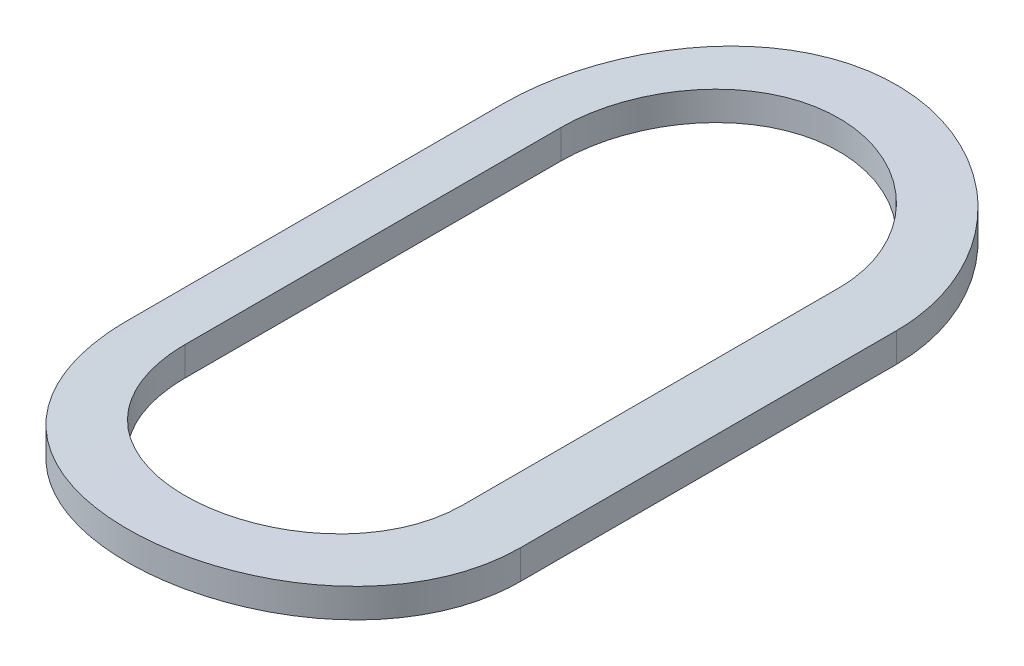
ISO-10303-21;
HEADER;
FILE_DESCRIPTION(('STEP AP214'),'2;1');
FILE_NAME('part.step','',(''),(''),'','','');
FILE_SCHEMA(('AUTOMOTIVE_DESIGN { 1 0 10303 214 1 1 1 1 }'));
ENDSEC;
DATA;
#1=APPLICATION_CONTEXT('core data for automotive mechanical design processes');
#2=APPLICATION_PROTOCOL_DEFINITION('international standard','automotive_design',2000,#1);
#3=PRODUCT_CONTEXT('',#1,'mechanical');
#4=PRODUCT('Part','Part','',(#3));
#5=PRODUCT_RELATED_PRODUCT_CATEGORY('part','',(#4));
#6=PRODUCT_DEFINITION_FORMATION('','',#4);
#7=PRODUCT_DEFINITION_CONTEXT('part definition',#1,'design');
#8=PRODUCT_DEFINITION('design','',#6,#7);
#9=PRODUCT_DEFINITION_SHAPE('','',#8);
#10=(LENGTH_UNIT() NAMED_UNIT(*) SI_UNIT(.MILLI.,.METRE.));
#11=(NAMED_UNIT(*) PLANE_ANGLE_UNIT() SI_UNIT($,.RADIAN.));
#12=(NAMED_UNIT(*) SI_UNIT($,.STERADIAN.) SOLID_ANGLE_UNIT());
#13=UNCERTAINTY_MEASURE_WITH_UNIT(LENGTH_MEASURE(1.E-05),#10,'distance_accuracy_value','');
#14=(GEOMETRIC_REPRESENTATION_CONTEXT(3) GLOBAL_UNCERTAINTY_ASSIGNED_CONTEXT((#13)) GLOBAL_UNIT_ASSIGNED_CONTEXT((#10,
#11,#12)) REPRESENTATION_CONTEXT('',''));
#15=CARTESIAN_POINT('',(0.,0.,0.));
#16=DIRECTION('',(0.,0.,1.));
#17=DIRECTION('',(1.,0.,0.));
#18=AXIS2_PLACEMENT_3D('',#15,#16,#17);
#19=CARTESIAN_POINT('',(-205.237767720161,-97.4477839792411,1.93657000024673));
#20=DIRECTION('',(0.,0.,1.));
#21=DIRECTION('',(1.,0.,0.));
#22=AXIS2_PLACEMENT_3D('',#19,#20,#21);
#23=CYLINDRICAL_SURFACE('',#22,5.00000000000003);
#24=CARTESIAN_POINT('',(-205.816025312001,-92.4813347287726,1.26705566906289));
#25=CARTESIAN_POINT('',(-205.81605345322,-92.4813470455981,1.23463948872488));
#26=CARTESIAN_POINT('',(-205.813301256707,-92.4810176953498,1.20223402357542));
#27=CARTESIAN_POINT('',(-205.802446677341,-92.4797671542148,1.13837574289803));
#28=CARTESIAN_POINT('',(-205.794349708049,-92.4788465622047,1.10692199708068));
#29=CARTESIAN_POINT('',(-205.773011592033,-92.4765042816047,1.04581857159093));
#30=CARTESIAN_POINT('',(-205.759768660538,-92.4750824191753,1.01616952197208));
#31=CARTESIAN_POINT('',(-205.728529674045,-92.4719021558279,0.959516628595261));
#32=CARTESIAN_POINT('',(-205.710534070537,-92.4701437868815,0.932512533908092));
#33=CARTESIAN_POINT('',(-205.670207756246,-92.4664783744416,0.881787170962236));
#34=CARTESIAN_POINT('',(-205.647859171863,-92.4645707380577,0.858080153163646));
#35=CARTESIAN_POINT('',(-205.599497501548,-92.460827112354,0.814741829426306));
#36=CARTESIAN_POINT('',(-205.573483858366,-92.4589911339836,0.795111144393086));
#37=CARTESIAN_POINT('',(-205.518441967116,-92.4555917582716,0.760434779110705));
#38=CARTESIAN_POINT('',(-205.489405485113,-92.4540291382538,0.745402085847956));
#39=CARTESIAN_POINT('',(-205.429200909222,-92.4513592357457,0.720432369036958));
#40=CARTESIAN_POINT('',(-205.398033010825,-92.4502519115612,0.710494878870033));
#41=CARTESIAN_POINT('',(-205.334596648131,-92.4486214638352,0.696039431545395));
#42=CARTESIAN_POINT('',(-205.302333729771,-92.4480957495245,0.691497433550026));
#43=CARTESIAN_POINT('',(-205.237498790808,-92.4476789168199,0.68788741976829));
#44=CARTESIAN_POINT('',(-205.204926773204,-92.4477877922755,0.688819350928871));
#45=CARTESIAN_POINT('',(-205.140563410856,-92.4486257894006,0.69611157320164));
#46=CARTESIAN_POINT('',(-205.108769075323,-92.4493519393145,0.702445856156936));
#47=CARTESIAN_POINT('',(-205.046697948224,-92.4513395212461,0.720322340750338));
#48=CARTESIAN_POINT('',(-205.016421173954,-92.4526009593627,0.731864601727575));
#49=CARTESIAN_POINT('',(-204.958162773233,-92.4555225006161,0.759857664963238));
#50=CARTESIAN_POINT('',(-204.930186698027,-92.4571835321094,0.776319919517496));
#51=CARTESIAN_POINT('',(-204.87738579882,-92.4607180906581,0.81367655545566));
#52=CARTESIAN_POINT('',(-204.852560962508,-92.4625916168832,0.834570919522312));
#53=CARTESIAN_POINT('',(-204.806616299284,-92.4663540775476,0.880341586026456));
#54=CARTESIAN_POINT('',(-204.785518493568,-92.4682430387985,0.905239996827522));
#55=CARTESIAN_POINT('',(-204.747792196947,-92.4718132541877,0.958244851151854));
#56=CARTESIAN_POINT('',(-204.731165046413,-92.473494445952,0.986352253189719));
#57=CARTESIAN_POINT('',(-204.702849827051,-92.4764596597479,1.04500439396428));
#58=CARTESIAN_POINT('',(-204.691166312109,-92.4777433152941,1.07555134927183));
#59=CARTESIAN_POINT('',(-204.67312304922,-92.479759834021,1.13815473004957));
#60=CARTESIAN_POINT('',(-204.666755270332,-92.4804935279044,1.170208800908));
#61=CARTESIAN_POINT('',(-204.660710580302,-92.4811955947182,1.22397438759136));
#62=CARTESIAN_POINT('',(-204.659499727931,-92.4813388156744,1.24552013612972));
#63=CARTESIAN_POINT('',(-204.659510128705,-92.4813347287279,1.26705566906289));
#64=B_SPLINE_CURVE_WITH_KNOTS('',3,(#24,#25,#26,#27,#28,#29,#30,#31,#32,#33,#34,#35,#36,#37,#38,
#39,#40,#41,#42,#43,#44,#45,#46,#47,#48,#49,#50,#51,#52,#53,#54,#55,#56,#57,#58,#59,#60,#61,#62,
#63),.UNSPECIFIED.,.F.,.F.,(4,2,2,2,2,2,2,2,2,2,2,2,2,2,2,2,2,2,2,4),(0.,0.0971144596016327,
0.194130705508774,0.291180629617421,0.3882213375778,0.485669235955009,0.583131966690333,
0.680867490696588,0.778594062484607,0.875883538275932,0.973172071143984,1.06999486157766,
1.16681875522746,1.2638698053772,1.36092047633352,1.4585266740161,1.55616210298787,
1.65388727516013,1.75146453691094,1.81606442695371),.UNSPECIFIED.);
#65=CARTESIAN_POINT('',(-205.816025312001,-92.4813347287725,1.26705566906289));
#66=VERTEX_POINT('',#65);
#67=CARTESIAN_POINT('',(-204.659510128705,-92.4813347287279,1.26705566906289));
#68=VERTEX_POINT('',#67);
#69=EDGE_CURVE('E173',#66,#68,#64,.T.);
#70=ORIENTED_EDGE('',*,*,#69,.T.);
#71=DIRECTION('',(0.,0.,1.));
#72=VECTOR('',#71,1.);
#73=CARTESIAN_POINT('',(-204.659510128705,-92.4813347287279,1.26705566906289));
#74=LINE('',#73,#72);
#75=CARTESIAN_POINT('',(-204.659510128705,-92.4813347287279,2.83206474743267));
#76=VERTEX_POINT('',#75);
#77=EDGE_CURVE('E111',#76,#68,#74,.F.);
#78=ORIENTED_EDGE('',*,*,#77,.F.);
#79=CARTESIAN_POINT('',(-204.659510128705,-92.4813347287279,2.83206474743267));
#80=CARTESIAN_POINT('',(-204.65948198318,-92.4813470453749,2.86448083062688));
#81=CARTESIAN_POINT('',(-204.66223416535,-92.4810176971892,2.89688619887213));
#82=CARTESIAN_POINT('',(-204.673088717127,-92.4797671597198,2.96074448500112));
#83=CARTESIAN_POINT('',(-204.681185705116,-92.4788465657793,2.99219832768205));
#84=CARTESIAN_POINT('',(-204.702524070631,-92.4765042566045,3.0533024933699));
#85=CARTESIAN_POINT('',(-204.715767326654,-92.4750823584012,3.08295215323607));
#86=CARTESIAN_POINT('',(-204.747006549714,-92.4719020810574,3.1396049404931));
#87=CARTESIAN_POINT('',(-204.765001863621,-92.4701437481661,3.16660843087947));
#88=CARTESIAN_POINT('',(-204.805325364428,-92.4664785790867,3.21733039993261));
#89=CARTESIAN_POINT('',(-204.827671036202,-92.4645711628689,3.24103493719126));
#90=CARTESIAN_POINT('',(-204.876032349208,-92.4608275253215,3.28437421471046));
#91=CARTESIAN_POINT('',(-204.902049364491,-92.4589913309773,3.30400742439501));
#92=CARTESIAN_POINT('',(-204.957107529511,-92.4555908299197,3.33869494452619));
#93=CARTESIAN_POINT('',(-204.986158174165,-92.4540274204009,3.35373426293954));
#94=CARTESIAN_POINT('',(-205.046371666948,-92.4513580548523,3.37869922051582));
#95=CARTESIAN_POINT('',(-205.077531998354,-92.4502515645608,3.3886308353169));
#96=CARTESIAN_POINT('',(-205.130346152671,-92.4488934431359,3.40066816087082));
#97=CARTESIAN_POINT('',(-205.151664012772,-92.4484793797971,3.40428335727668));
#98=CARTESIAN_POINT('',(-205.194574057236,-92.4479245041211,3.40911092828111));
#99=CARTESIAN_POINT('',(-205.216166245618,-92.4477836957932,3.41032326762364));
#100=CARTESIAN_POINT('',(-205.270132833281,-92.4477844039261,3.41032094786131));
#101=CARTESIAN_POINT('',(-205.302518792684,-92.448101558574,3.40759595145512));
#102=CARTESIAN_POINT('',(-205.36639046982,-92.449336246177,3.39676770255847));
#103=CARTESIAN_POINT('',(-205.397875198235,-92.4502544143552,3.38865875953881));
#104=CARTESIAN_POINT('',(-205.459010687186,-92.4525875978119,3.36730369344967));
#105=CARTESIAN_POINT('',(-205.488662624789,-92.4540022902267,3.35406090806612));
#106=CARTESIAN_POINT('',(-205.545317635545,-92.4571708752444,3.32282065546445));
#107=CARTESIAN_POINT('',(-205.572321144898,-92.4589247118479,3.30482397303095));
#108=CARTESIAN_POINT('',(-205.623045523049,-92.4625847434808,3.26449632593292));
#109=CARTESIAN_POINT('',(-205.646752120136,-92.4644915478026,3.24214746487877));
#110=CARTESIAN_POINT('',(-205.690087991771,-92.4682377457699,3.19378617130073));
#111=CARTESIAN_POINT('',(-205.709716908808,-92.4700771334931,3.16777341788066));
#112=CARTESIAN_POINT('',(-205.744395340358,-92.4734866329095,3.11272837641825));
#113=CARTESIAN_POINT('',(-205.759430426865,-92.4750558895899,3.083686951524));
#114=CARTESIAN_POINT('',(-205.784398136002,-92.4777383200303,3.02347434336882));
#115=CARTESIAN_POINT('',(-205.794333600315,-92.4788517477236,2.99230435721046));
#116=CARTESIAN_POINT('',(-205.806375173798,-92.4802182866102,2.93946661392135));
#117=CARTESIAN_POINT('',(-205.809991257807,-92.4806348583557,2.91813495665772));
#118=CARTESIAN_POINT('',(-205.81481628588,-92.4811939415349,2.87522689266801));
#119=CARTESIAN_POINT('',(-205.816028473882,-92.4813368222921,2.85365085534277));
#120=CARTESIAN_POINT('',(-205.816025312001,-92.4813347287726,2.83206474743267));
#121=B_SPLINE_CURVE_WITH_KNOTS('',3,(#79,#80,#81,#82,#83,#84,#85,#86,#87,#88,#89,#90,#91,#92,
#93,#94,#95,#96,#97,#98,#99,#100,#101,#102,#103,#104,#105,#106,#107,#108,#109,#110,#111,#112,
#113,#114,#115,#116,#117,#118,#119,#120),.UNSPECIFIED.,.F.,.F.,(4,2,2,2,2,2,2,2,2,2,2,2,2,2,2,2,
2,2,2,2,4),(0.,0.0971141698560029,0.194130705514869,0.291182687565263,0.38822133755357,
0.485658369900073,0.583131966607677,0.680920348294443,0.778594063001647,0.843344867671632,
0.908096622394172,1.00511304740932,1.10223217692015,1.19928827157682,1.29632835398478,
1.3937762336066,1.49123265335908,1.58899208404563,1.68669698057032,1.75148885975865,
1.81619324588166),.UNSPECIFIED.);
#122=CARTESIAN_POINT('',(-205.816025312001,-92.4813347287725,2.83206474743267));
#123=VERTEX_POINT('',#122);
#124=EDGE_CURVE('E118',#76,#123,#121,.T.);
#125=ORIENTED_EDGE('',*,*,#124,.T.);
#126=DIRECTION('',(0.,0.,-1.));
#127=VECTOR('',#126,1.);
#128=CARTESIAN_POINT('',(-205.816025312001,-92.4813347287725,2.83206474743267));
#129=LINE('',#128,#127);
#130=EDGE_CURVE('E115',#66,#123,#129,.F.);
#131=ORIENTED_EDGE('',*,*,#130,.F.);
#132=EDGE_LOOP('',(#70,#78,#125,#131));
#133=FACE_BOUND('',#132,.T.);
#134=DIRECTION('',(0.,0.,1.));
#135=VECTOR('',#134,1.);
#136=CARTESIAN_POINT('',(-206.056025312001,-92.5151929244914,1.26705559221961));
#137=LINE('',#136,#135);
#138=CARTESIAN_POINT('',(-206.056025312001,-92.5151929244914,2.83206489963483));
#139=VERTEX_POINT('',#138);
#140=CARTESIAN_POINT('',(-206.056025312001,-92.5151929244914,1.26705564985207));
#141=VERTEX_POINT('',#140);
#142=EDGE_CURVE('E98',#139,#141,#137,.F.);
#143=ORIENTED_EDGE('',*,*,#142,.F.);
#144=CARTESIAN_POINT('',(-204.419510128705,-92.5151929244278,2.83206478585431));
#145=CARTESIAN_POINT('',(-204.419469583894,-92.5152177455033,2.87777147739796));
#146=CARTESIAN_POINT('',(-204.423337202401,-92.514558298794,2.92345946863485));
#147=CARTESIAN_POINT('',(-204.438581215502,-92.5120563218705,3.01347416657745));
#148=CARTESIAN_POINT('',(-204.449947946265,-92.5102153143735,3.05780254852657));
#149=CARTESIAN_POINT('',(-204.479887760545,-92.505534208199,3.14390882887328));
#150=CARTESIAN_POINT('',(-204.498462619333,-92.5026938634135,3.18568609602752));
#151=CARTESIAN_POINT('',(-204.542264858439,-92.496343081097,3.26553173869358));
#152=CARTESIAN_POINT('',(-204.567492006978,-92.4928326669135,3.30360024336224));
#153=CARTESIAN_POINT('',(-204.624135409762,-92.4854987717767,3.37530128514741));
#154=CARTESIAN_POINT('',(-204.65560135479,-92.481672931592,3.40889432927821));
#155=CARTESIAN_POINT('',(-204.723733811126,-92.4741593685713,3.47035939904949));
#156=CARTESIAN_POINT('',(-204.760402239161,-92.4704716972759,3.49822930683726));
#157=CARTESIAN_POINT('',(-204.838163315761,-92.4636242885595,3.54760415496366));
#158=CARTESIAN_POINT('',(-204.87928180731,-92.4604679404276,3.5690688613223));
#159=CARTESIAN_POINT('',(-204.964570477406,-92.4550711398516,3.60474879480461));
#160=CARTESIAN_POINT('',(-205.008736994849,-92.4528296102206,3.61897255296315));
#161=CARTESIAN_POINT('',(-205.083910694341,-92.4500602914303,3.63632344402966));
#162=CARTESIAN_POINT('',(-205.114434780676,-92.4492108397193,3.64156518110267));
#163=CARTESIAN_POINT('',(-205.175890775964,-92.4480724009212,3.64856531130345));
#164=CARTESIAN_POINT('',(-205.206822688049,-92.4477834181408,3.65032367766514));
#165=CARTESIAN_POINT('',(-205.283398607863,-92.4477848066276,3.65032036523282));
#166=CARTESIAN_POINT('',(-205.329058023749,-92.448415213171,3.64649211968619));
#167=CARTESIAN_POINT('',(-205.419099966746,-92.450869588219,3.63128507440123));
#168=CARTESIAN_POINT('',(-205.463481130311,-92.4526947853451,3.61989850215043));
#169=CARTESIAN_POINT('',(-205.549646007249,-92.4573338703443,3.58992731322613));
#170=CARTESIAN_POINT('',(-205.591431903344,-92.4601469137761,3.57134884302327));
#171=CARTESIAN_POINT('',(-205.671287461548,-92.4664521176568,3.5275361761613));
#172=CARTESIAN_POINT('',(-205.709357582195,-92.4699441941514,3.50230280216413));
#173=CARTESIAN_POINT('',(-205.781057576196,-92.4772560952725,3.44564959471385));
#174=CARTESIAN_POINT('',(-205.814648260083,-92.481078384344,3.41418047881052));
#175=CARTESIAN_POINT('',(-205.876098923618,-92.4886011796767,3.34605227981666));
#176=CARTESIAN_POINT('',(-205.903958316683,-92.4923016734399,3.30939266614047));
#177=CARTESIAN_POINT('',(-205.953315865383,-92.4991864135317,3.23165192320347));
#178=CARTESIAN_POINT('',(-205.974773689082,-92.5023673318523,3.19054489544946));
#179=CARTESIAN_POINT('',(-206.010454954267,-92.5078161409318,3.10525570250481));
#180=CARTESIAN_POINT('',(-206.024682761172,-92.510084582463,3.06107541128852));
#181=CARTESIAN_POINT('',(-206.042035603347,-92.5128875242913,2.98587440469699));
#182=CARTESIAN_POINT('',(-206.047276741209,-92.5137474123375,2.95533733217677));
#183=CARTESIAN_POINT('',(-206.054272095082,-92.5149020576824,2.89389316153447));
#184=CARTESIAN_POINT('',(-206.056030475274,-92.5151974898613,2.86298654981203));
#185=CARTESIAN_POINT('',(-206.056025312001,-92.5151929244915,2.83206489963483));
#186=B_SPLINE_CURVE_WITH_KNOTS('',3,(#144,#145,#146,#147,#148,#149,#150,#151,#152,#153,#154,
#155,#156,#157,#158,#159,#160,#161,#162,#163,#164,#165,#166,#167,#168,#169,#170,#171,#172,#173,
#174,#175,#176,#177,#178,#179,#180,#181,#182,#183,#184,#185),.UNSPECIFIED.,.F.,.F.,(4,2,2,2,2,2,
2,2,2,2,2,2,2,2,2,2,2,2,2,2,4),(0.,0.136923950960332,0.273671796791195,0.410453343293103,
0.54723012470334,0.685143554436085,0.823107927577547,0.961921508066514,1.10057116248184,
1.19332857538333,1.28608670102633,1.42286586335767,1.55978589921435,1.69658917540756,
1.83337554825506,1.97128949854096,2.10921755692804,2.24799709478118,2.38669273896364,
2.47948852703615,2.57217329610049),.UNSPECIFIED.);
#187=CARTESIAN_POINT('',(-204.419510128705,-92.5151929244278,2.83206476664349));
#188=VERTEX_POINT('',#187);
#189=EDGE_CURVE('E21',#188,#139,#186,.T.);
#190=ORIENTED_EDGE('',*,*,#189,.F.);
#191=DIRECTION('',(0.,0.,-1.));
#192=VECTOR('',#191,1.);
#193=CARTESIAN_POINT('',(-204.419510128705,-92.5151929244278,2.83206482427595));
#194=LINE('',#193,#192);
#195=CARTESIAN_POINT('',(-204.419510128705,-92.5151929244278,1.26705548326462));
#196=VERTEX_POINT('',#195);
#197=EDGE_CURVE('E85',#196,#188,#194,.F.);
#198=ORIENTED_EDGE('',*,*,#197,.F.);
#199=CARTESIAN_POINT('',(-206.056025312001,-92.5151929244915,1.26705563064125));
#200=CARTESIAN_POINT('',(-206.056065850808,-92.515217745583,1.22134883097487));
#201=CARTESIAN_POINT('',(-206.052198216996,-92.5145582957453,1.17566073182648));
#202=CARTESIAN_POINT('',(-206.036954174544,-92.5120563133006,1.08564603993076));
#203=CARTESIAN_POINT('',(-206.025587465142,-92.5102153089893,1.04131776579762));
#204=CARTESIAN_POINT('',(-205.995647976741,-92.505534255493,0.955212458491268));
#205=CARTESIAN_POINT('',(-205.977073551117,-92.502693978035,0.913436010816652));
#206=CARTESIAN_POINT('',(-205.933271629356,-92.4963432223219,0.833590226531871));
#207=CARTESIAN_POINT('',(-205.908044096061,-92.4928327403238,0.795520910628242));
#208=CARTESIAN_POINT('',(-205.851396862148,-92.485498374046,0.72381522193847));
#209=CARTESIAN_POINT('',(-205.819926933647,-92.4816721051632,0.690218766535334));
#210=CARTESIAN_POINT('',(-205.751793995122,-92.4741585643196,0.628754998734168));
#211=CARTESIAN_POINT('',(-205.715130190961,-92.4704713137239,0.600888564049017));
#212=CARTESIAN_POINT('',(-205.637391631918,-92.463626125481,0.551529285253124));
#213=CARTESIAN_POINT('',(-205.596292805583,-92.4604713419292,0.530073877562667));
#214=CARTESIAN_POINT('',(-205.511016664348,-92.4550734914938,0.494387328495326));
#215=CARTESIAN_POINT('',(-205.466839718733,-92.4528303154637,0.480155322212712));
#216=CARTESIAN_POINT('',(-205.377075908382,-92.4495251357669,0.459440994753696));
#217=CARTESIAN_POINT('',(-205.331505067711,-92.4484528095476,0.452890908829178));
#218=CARTESIAN_POINT('',(-205.239898318281,-92.4475746926404,0.447515657238125));
#219=CARTESIAN_POINT('',(-205.193862429081,-92.4477688489088,0.448690168044297));
#220=CARTESIAN_POINT('',(-205.103097894796,-92.4493936818346,0.458678086554265));
#221=CARTESIAN_POINT('',(-205.058360960137,-92.4508125204654,0.467418364329662));
#222=CARTESIAN_POINT('',(-204.970997657123,-92.4547140846072,0.492174575241048));
#223=CARTESIAN_POINT('',(-204.928371337958,-92.4571968349013,0.508190677863659));
#224=CARTESIAN_POINT('',(-204.84622004591,-92.4629674986844,0.547117287105559));
#225=CARTESIAN_POINT('',(-204.806709726253,-92.4662589478132,0.570058172428767));
#226=CARTESIAN_POINT('',(-204.732073401851,-92.4732809318163,0.622160081277464));
#227=CARTESIAN_POINT('',(-204.696947574812,-92.4770114844759,0.651321356789106));
#228=CARTESIAN_POINT('',(-204.631648055881,-92.484547753114,0.715437722954601));
#229=CARTESIAN_POINT('',(-204.60153640729,-92.4883538392547,0.75045598431607));
#230=CARTESIAN_POINT('',(-204.547597917773,-92.4955714661168,0.825092875202568));
#231=CARTESIAN_POINT('',(-204.523772874036,-92.4989828938587,0.864712815584657));
#232=CARTESIAN_POINT('',(-204.483072318769,-92.5050255837505,0.947504547680571));
#233=CARTESIAN_POINT('',(-204.46620814016,-92.5076555717108,0.990681995335595));
#234=CARTESIAN_POINT('',(-204.440013102122,-92.5118173602202,1.0792796810168));
#235=CARTESIAN_POINT('',(-204.430670974507,-92.5133508030295,1.1246964557576));
#236=CARTESIAN_POINT('',(-204.4233185101,-92.5145624854378,1.18655685847431));
#237=CARTESIAN_POINT('',(-204.421889767019,-92.5147986920222,1.2026367404691));
#238=CARTESIAN_POINT('',(-204.419986824293,-92.5151137500438,1.23482723756643));
#239=CARTESIAN_POINT('',(-204.419511019327,-92.515192866114,1.25093775514238));
#240=CARTESIAN_POINT('',(-204.419510128705,-92.5151929244277,1.26705548326462));
#241=B_SPLINE_CURVE_WITH_KNOTS('',3,(#199,#200,#201,#202,#203,#204,#205,#206,#207,#208,#209,
#210,#211,#212,#213,#214,#215,#216,#217,#218,#219,#220,#221,#222,#223,#224,#225,#226,#227,#228,
#229,#230,#231,#232,#233,#234,#235,#236,#237,#238,#239,#240),.UNSPECIFIED.,.F.,.F.,(4,2,2,2,2,2,
2,2,2,2,2,2,2,2,2,2,2,2,2,2,4),(0.,0.136924273568553,0.273671796779466,0.410450578793855,
0.547230124755248,0.685158470322036,0.823107927758302,0.961847852289614,1.10057116064878,
1.23806131441293,1.37554570974907,1.51171584881383,1.64788916005504,1.7846687604858,
1.92145390287001,2.05982271657082,2.19823104382083,2.33686383193082,2.47528855687436,
2.52370175778949,2.57203333292965),.UNSPECIFIED.);
#242=EDGE_CURVE('E99',#141,#196,#241,.T.);
#243=ORIENTED_EDGE('',*,*,#242,.F.);
#244=EDGE_LOOP('',(#143,#190,#198,#243));
#245=FACE_BOUND('',#244,.T.);
#246=ADVANCED_FACE('F17',(#133,#245),#23,.T.);
#247=CARTESIAN_POINT('',(-206.056025312001,-90.5682667595488,1.26705559221961));
#248=DIRECTION('',(-1.,0.,0.));
#249=DIRECTION('',(0.,0.,1.));
#250=AXIS2_PLACEMENT_3D('',#247,#248,#249);
#251=PLANE('',#250);
#252=ORIENTED_EDGE('',*,*,#142,.T.);
#253=DIRECTION('',(0.,1.,0.));
#254=VECTOR('',#253,1.);
#255=CARTESIAN_POINT('',(-206.056025312001,-90.5682667595488,1.26705563064125));
#256=LINE('',#255,#254);
#257=CARTESIAN_POINT('',(-206.056025312001,-92.6368740327345,1.26705564985207));
#258=VERTEX_POINT('',#257);
#259=EDGE_CURVE('E168',#258,#141,#256,.T.);
#260=ORIENTED_EDGE('',*,*,#259,.F.);
#261=DIRECTION('',(0.,0.,1.));
#262=VECTOR('',#261,1.);
#263=CARTESIAN_POINT('',(-206.056025312001,-92.6368740327345,1.93657000024673));
#264=LINE('',#263,#262);
#265=CARTESIAN_POINT('',(-206.056025312001,-92.6368740327345,2.83206489963483));
#266=VERTEX_POINT('',#265);
#267=EDGE_CURVE('E106',#258,#266,#264,.T.);
#268=ORIENTED_EDGE('',*,*,#267,.T.);
#269=DIRECTION('',(0.,1.,0.));
#270=VECTOR('',#269,1.);
#271=CARTESIAN_POINT('',(-206.056025312001,-90.5682667595488,2.83206489963483));
#272=LINE('',#271,#270);
#273=EDGE_CURVE('E93',#139,#266,#272,.F.);
#274=ORIENTED_EDGE('',*,*,#273,.F.);
#275=EDGE_LOOP('',(#252,#260,#268,#274));
#276=FACE_BOUND('',#275,.T.);
#277=ADVANCED_FACE('F105',(#276),#251,.T.);
#278=CARTESIAN_POINT('',(-205.237767720353,-90.5682667595488,2.83206474743267));
#279=DIRECTION('',(0.,1.,0.));
#280=DIRECTION('',(0.,0.,1.));
#281=AXIS2_PLACEMENT_3D('',#278,#279,#280);
#282=CYLINDRICAL_SURFACE('',#281,0.818257591648157);
#283=DIRECTION('',(0.,1.,0.));
#284=VECTOR('',#283,1.);
#285=CARTESIAN_POINT('',(-204.419510128705,-90.5682667595488,2.83206478585431));
#286=LINE('',#285,#284);
#287=CARTESIAN_POINT('',(-204.419510128705,-92.6368740326692,2.83206476664349));
#288=VERTEX_POINT('',#287);
#289=EDGE_CURVE('E95',#188,#288,#286,.F.);
#290=ORIENTED_EDGE('',*,*,#289,.F.);
#291=ORIENTED_EDGE('',*,*,#189,.T.);
#292=ORIENTED_EDGE('',*,*,#273,.T.);
#293=CARTESIAN_POINT('',(-206.056025312001,-92.6368740327345,2.83206489963483));
#294=CARTESIAN_POINT('',(-206.056065921352,-92.6368994793883,2.87775530900821));
#295=CARTESIAN_POINT('',(-206.052200966113,-92.6362238161791,2.92342666331074));
#296=CARTESIAN_POINT('',(-206.036968439681,-92.6336605145276,3.013406742857));
#297=CARTESIAN_POINT('',(-206.025610733758,-92.6317744698129,3.05771717976552));
#298=CARTESIAN_POINT('',(-205.995696237809,-92.6269791620225,3.14378771652208));
#299=CARTESIAN_POINT('',(-205.977137759895,-92.6240696590593,3.18554721576247));
#300=CARTESIAN_POINT('',(-205.933375508098,-92.6175644569927,3.26536088862755));
#301=CARTESIAN_POINT('',(-205.908171898375,-92.613968774841,3.30341515375338));
#302=CARTESIAN_POINT('',(-205.851569911574,-92.6064550500433,3.3751087961314));
#303=CARTESIAN_POINT('',(-205.820119377924,-92.6025344673586,3.40870673375215));
#304=CARTESIAN_POINT('',(-205.752017050511,-92.5948343659367,3.47018537945224));
#305=CARTESIAN_POINT('',(-205.715363342521,-92.5910548997649,3.49806397413739));
#306=CARTESIAN_POINT('',(-205.637617200762,-92.5840351827162,3.54746775498627));
#307=CARTESIAN_POINT('',(-205.59649765922,-92.5807985674395,3.56895079697884));
#308=CARTESIAN_POINT('',(-205.511200595883,-92.5752637467863,3.60466607111945));
#309=CARTESIAN_POINT('',(-205.467026745235,-92.5729644369773,3.6189068418073));
#310=CARTESIAN_POINT('',(-205.39180925086,-92.5701219000218,3.6362895389799));
#311=CARTESIAN_POINT('',(-205.361249460828,-92.569249467263,3.64154392844038));
#312=CARTESIAN_POINT('',(-205.299720061526,-92.5680802177776,3.64856101104965));
#313=CARTESIAN_POINT('',(-205.26875044941,-92.5677834050525,3.65032367992549));
#314=CARTESIAN_POINT('',(-205.192153355237,-92.567784824591,3.65032036502044));
#315=CARTESIAN_POINT('',(-205.146510558836,-92.5684302632369,3.64649485741542));
#316=CARTESIAN_POINT('',(-205.056502147742,-92.5709431824667,3.63129919714622));
#317=CARTESIAN_POINT('',(-205.012137892963,-92.5728119175024,3.61992129957627));
#318=CARTESIAN_POINT('',(-204.926007053466,-92.5775617659709,3.58997447920949));
#319=CARTESIAN_POINT('',(-204.88423823572,-92.580441994546,3.57141184020107));
#320=CARTESIAN_POINT('',(-204.804413714789,-92.5868982541706,3.52763797228319));
#321=CARTESIAN_POINT('',(-204.766357568201,-92.5904742019774,3.50242753865315));
#322=CARTESIAN_POINT('',(-204.694665515389,-92.5979641700168,3.4458151817417));
#323=CARTESIAN_POINT('',(-204.661070638303,-92.6018808441097,3.41436164890218));
#324=CARTESIAN_POINT('',(-204.59960769215,-92.609590759877,3.34626415093315));
#325=CARTESIAN_POINT('',(-204.571740218754,-92.6133839886781,3.30961964659192));
#326=CARTESIAN_POINT('',(-204.522354353636,-92.6204438996072,3.23189412449367));
#327=CARTESIAN_POINT('',(-204.500878322293,-92.6237070063014,3.19078586841621));
#328=CARTESIAN_POINT('',(-204.465162052465,-92.6292977740442,3.10548806762467));
#329=CARTESIAN_POINT('',(-204.450917412383,-92.6316260039523,3.06130041594992));
#330=CARTESIAN_POINT('',(-204.433533272905,-92.6345047311212,2.98605631608713));
#331=CARTESIAN_POINT('',(-204.428279714226,-92.6353884213789,2.95548431409597));
#332=CARTESIAN_POINT('',(-204.421267581236,-92.636575088953,2.89396785577451));
#333=CARTESIAN_POINT('',(-204.41950488892,-92.6368787504859,2.86302388166687));
#334=CARTESIAN_POINT('',(-204.419510128705,-92.6368740326692,2.83206478585431));
#335=B_SPLINE_CURVE_WITH_KNOTS('',3,(#293,#294,#295,#296,#297,#298,#299,#300,#301,#302,#303,
#304,#305,#306,#307,#308,#309,#310,#311,#312,#313,#314,#315,#316,#317,#318,#319,#320,#321,#322,
#323,#324,#325,#326,#327,#328,#329,#330,#331,#332,#333,#334),.UNSPECIFIED.,.F.,.F.,(4,2,2,2,2,2,
2,2,2,2,2,2,2,2,2,2,2,2,2,2,4),(0.,0.136874463677233,0.273569071423,0.410295740272831,
0.547019031786762,0.684935848575123,0.822903536535388,0.961761216109329,1.10045480260568,
1.19332512698137,1.28619609694948,1.42292550916479,1.55979535319295,1.69654576010989,
1.83327981491468,1.97119518154857,2.10912488464851,2.24794936215897,2.38668923844876,
2.47959560857872,2.57239231615866),.UNSPECIFIED.);
#336=EDGE_CURVE('E150',#266,#288,#335,.T.);
#337=ORIENTED_EDGE('',*,*,#336,.T.);
#338=EDGE_LOOP('',(#290,#291,#292,#337));
#339=FACE_BOUND('',#338,.T.);
#340=ADVANCED_FACE('F91',(#339),#282,.T.);
#341=CARTESIAN_POINT('',(-204.419510128705,-90.5682667595488,2.83206482427595));
#342=DIRECTION('',(1.,0.,0.));
#343=DIRECTION('',(0.,0.,-1.));
#344=AXIS2_PLACEMENT_3D('',#341,#342,#343);
#345=PLANE('',#344);
#346=ORIENTED_EDGE('',*,*,#197,.T.);
#347=ORIENTED_EDGE('',*,*,#289,.T.);
#348=DIRECTION('',(0.,0.,1.));
#349=VECTOR('',#348,1.);
#350=CARTESIAN_POINT('',(-204.419510128705,-92.6368740326692,1.93657000024673));
#351=LINE('',#350,#349);
#352=CARTESIAN_POINT('',(-204.419510128705,-92.6368740326692,1.26705548326462));
#353=VERTEX_POINT('',#352);
#354=EDGE_CURVE('E149',#288,#353,#351,.F.);
#355=ORIENTED_EDGE('',*,*,#354,.T.);
#356=DIRECTION('',(0.,1.,0.));
#357=VECTOR('',#356,1.);
#358=CARTESIAN_POINT('',(-204.419510128705,-90.5682667595488,1.26705548326462));
#359=LINE('',#358,#357);
#360=EDGE_CURVE('E114',#196,#353,#359,.F.);
#361=ORIENTED_EDGE('',*,*,#360,.F.);
#362=EDGE_LOOP('',(#346,#347,#355,#361));
#363=FACE_BOUND('',#362,.T.);
#364=ADVANCED_FACE('F161',(#363),#345,.T.);
#365=CARTESIAN_POINT('',(-205.237767720353,-90.5682667595488,1.26705566906289));
#366=DIRECTION('',(0.,1.,0.));
#367=DIRECTION('',(0.,0.,1.));
#368=AXIS2_PLACEMENT_3D('',#365,#366,#367);
#369=CYLINDRICAL_SURFACE('',#368,0.818257591648161);
#370=ORIENTED_EDGE('',*,*,#360,.T.);
#371=CARTESIAN_POINT('',(-204.419510128705,-92.6368740326692,1.26705548326462));
#372=CARTESIAN_POINT('',(-204.419469527225,-92.6368994790153,1.22136496853356));
#373=CARTESIAN_POINT('',(-204.423334499175,-92.6362238123658,1.17569350923937));
#374=CARTESIAN_POINT('',(-204.438567057757,-92.6336605046037,1.08571343610669));
#375=CARTESIAN_POINT('',(-204.449924744654,-92.6317744627864,1.04140310461827));
#376=CARTESIAN_POINT('',(-204.479838920958,-92.6269792080743,0.955333534813714));
#377=CARTESIAN_POINT('',(-204.498396970002,-92.62406977352,0.913574851468085));
#378=CARTESIAN_POINT('',(-204.542158909519,-92.6175645982258,0.83376103955682));
#379=CARTESIAN_POINT('',(-204.567362903171,-92.6139688468309,0.79570596850331));
#380=CARTESIAN_POINT('',(-204.623968709372,-92.6064546407439,0.724007696916366));
#381=CARTESIAN_POINT('',(-204.65542321429,-92.6025336200587,0.690406359128123));
#382=CARTESIAN_POINT('',(-204.723526024272,-92.5948335412902,0.628929013449309));
#383=CARTESIAN_POINT('',(-204.760175124282,-92.5910545050476,0.601053883464359));
#384=CARTESIAN_POINT('',(-204.837898801738,-92.584037059949,0.551665653309362));
#385=CARTESIAN_POINT('',(-204.878998716773,-92.5808020462126,0.530191903775169));
#386=CARTESIAN_POINT('',(-204.964283262063,-92.5752661529562,0.494470029694662));
#387=CARTESIAN_POINT('',(-205.00846751354,-92.5729651589676,0.480221019668374));
#388=CARTESIAN_POINT('',(-205.098231495951,-92.5695745579261,0.459480766770577));
#389=CARTESIAN_POINT('',(-205.143794374454,-92.5684738560823,0.452918430138299));
#390=CARTESIAN_POINT('',(-205.235387982224,-92.5675697244729,0.447516676789501));
#391=CARTESIAN_POINT('',(-205.281418690319,-92.5677662362586,0.448676912116737));
#392=CARTESIAN_POINT('',(-205.37215278697,-92.5694256607581,0.458632249723411));
#393=CARTESIAN_POINT('',(-205.416864859033,-92.5708758478578,0.467350634396521));
#394=CARTESIAN_POINT('',(-205.504182029489,-92.5748654685862,0.492053907200297));
#395=CARTESIAN_POINT('',(-205.546787076565,-92.5774049287311,0.508038972223942));
#396=CARTESIAN_POINT('',(-205.62890970343,-92.5833094534524,0.546898241600185));
#397=CARTESIAN_POINT('',(-205.668412004834,-92.5866783022803,0.569804135656715));
#398=CARTESIAN_POINT('',(-205.743039629468,-92.5938672229189,0.621830825117567));
#399=CARTESIAN_POINT('',(-205.778164756255,-92.597687314966,0.650951899294968));
#400=CARTESIAN_POINT('',(-205.843491667654,-92.6054089823972,0.715003223760648));
#401=CARTESIAN_POINT('',(-205.873628400287,-92.6093109837776,0.749999799097209));
#402=CARTESIAN_POINT('',(-205.927621066643,-92.6167129150722,0.824599024443642));
#403=CARTESIAN_POINT('',(-205.951475211383,-92.6202127303033,0.864202981799649));
#404=CARTESIAN_POINT('',(-205.992238794717,-92.6264147834324,0.946974295579837));
#405=CARTESIAN_POINT('',(-206.009136267758,-92.6291156448943,0.990147639539776));
#406=CARTESIAN_POINT('',(-206.035397032701,-92.6333922732365,1.07874581626889));
#407=CARTESIAN_POINT('',(-206.044771587227,-92.6349697215878,1.12416717486492));
#408=CARTESIAN_POINT('',(-206.052175513482,-92.636220632103,1.18612132631733));
#409=CARTESIAN_POINT('',(-206.053619786999,-92.6364654369652,1.20228780369826));
#410=CARTESIAN_POINT('',(-206.055543430648,-92.6367919731673,1.23465237181172));
#411=CARTESIAN_POINT('',(-206.056024423464,-92.6368739787471,1.25085036329265));
#412=CARTESIAN_POINT('',(-206.056025312001,-92.6368740327345,1.26705563064125));
#413=B_SPLINE_CURVE_WITH_KNOTS('',3,(#371,#372,#373,#374,#375,#376,#377,#378,#379,#380,#381,
#382,#383,#384,#385,#386,#387,#388,#389,#390,#391,#392,#393,#394,#395,#396,#397,#398,#399,#400,
#401,#402,#403,#404,#405,#406,#407,#408,#409,#410,#411,#412),.UNSPECIFIED.,.F.,.F.,(4,2,2,2,2,2,
2,2,2,2,2,2,2,2,2,2,2,2,2,2,4),(0.,0.136874778041383,0.273569071770026,0.410292990760095,
0.547019032550411,0.68495071968349,0.822903537865668,0.96168767669374,1.10045480171818,
1.23792807863377,1.37539516145216,1.5114830335167,1.64757421854905,1.78429824461452,
1.92102840453134,2.05942097460008,2.19785290982674,2.33652196465284,2.47498302754966,
2.52365902880849,2.57225296417636),.UNSPECIFIED.);
#414=EDGE_CURVE('E142',#353,#258,#413,.T.);
#415=ORIENTED_EDGE('',*,*,#414,.T.);
#416=ORIENTED_EDGE('',*,*,#259,.T.);
#417=ORIENTED_EDGE('',*,*,#242,.T.);
#418=EDGE_LOOP('',(#370,#415,#416,#417));
#419=FACE_BOUND('',#418,.T.);
#420=ADVANCED_FACE('F155',(#419),#369,.T.);
#421=CARTESIAN_POINT('',(-204.659510128705,-90.5682667595488,1.26705566906289));
#422=DIRECTION('',(-1.,0.,0.));
#423=DIRECTION('',(0.,0.,1.));
#424=AXIS2_PLACEMENT_3D('',#421,#422,#423);
#425=PLANE('',#424);
#426=ORIENTED_EDGE('',*,*,#77,.T.);
#427=DIRECTION('',(0.,1.,0.));
#428=VECTOR('',#427,1.);
#429=CARTESIAN_POINT('',(-204.659510128705,-90.5682667595488,1.26705566906289));
#430=LINE('',#429,#428);
#431=CARTESIAN_POINT('',(-204.659510128705,-92.6021655297629,1.26705566906289));
#432=VERTEX_POINT('',#431);
#433=EDGE_CURVE('E211',#68,#432,#430,.F.);
#434=ORIENTED_EDGE('',*,*,#433,.T.);
#435=DIRECTION('',(0.,0.,1.));
#436=VECTOR('',#435,1.);
#437=CARTESIAN_POINT('',(-204.659510128705,-92.6021655297629,1.93657000024673));
#438=LINE('',#437,#436);
#439=CARTESIAN_POINT('',(-204.659510128705,-92.6021655297629,2.83206474743267));
#440=VERTEX_POINT('',#439);
#441=EDGE_CURVE('E148',#432,#440,#438,.T.);
#442=ORIENTED_EDGE('',*,*,#441,.T.);
#443=DIRECTION('',(0.,1.,0.));
#444=VECTOR('',#443,1.);
#445=CARTESIAN_POINT('',(-204.659510128705,-90.5682667595488,2.83206474743267));
#446=LINE('',#445,#444);
#447=EDGE_CURVE('E113',#440,#76,#446,.T.);
#448=ORIENTED_EDGE('',*,*,#447,.T.);
#449=EDGE_LOOP('',(#426,#434,#442,#448));
#450=FACE_BOUND('',#449,.T.);
#451=ADVANCED_FACE('F160',(#450),#425,.T.);
#452=CARTESIAN_POINT('',(-205.237767720353,-90.5682667595488,2.83206474743267));
#453=DIRECTION('',(0.,1.,0.));
#454=DIRECTION('',(0.,0.,1.));
#455=AXIS2_PLACEMENT_3D('',#452,#453,#454);
#456=CYLINDRICAL_SURFACE('',#455,0.578257591648153);
#457=CARTESIAN_POINT('',(-204.659510128705,-92.6021655297629,2.83206474743267));
#458=CARTESIAN_POINT('',(-204.659481957695,-92.602178153299,2.86447510734898));
#459=CARTESIAN_POINT('',(-204.662233198427,-92.601840707234,2.89687462882666));
#460=CARTESIAN_POINT('',(-204.673083692295,-92.6005594712664,2.96072074587449));
#461=CARTESIAN_POINT('',(-204.681177491197,-92.5996162997775,2.99216827912426));
#462=CARTESIAN_POINT('',(-204.702506907944,-92.5972166227029,3.05325988359358));
#463=CARTESIAN_POINT('',(-204.715744373165,-92.5957599327018,3.08290330242654));
#464=CARTESIAN_POINT('',(-204.746969457657,-92.5925018903091,3.13954487913976));
#465=CARTESIAN_POINT('',(-204.764956448485,-92.5907005835248,3.16654338633945));
#466=CARTESIAN_POINT('',(-204.805265366014,-92.5869454143583,3.21726286129918));
#467=CARTESIAN_POINT('',(-204.827605658019,-92.5849909274029,3.24096918801936));
#468=CARTESIAN_POINT('',(-204.87595648471,-92.581154785793,3.28431336897695));
#469=CARTESIAN_POINT('',(-204.901968392402,-92.5792731587216,3.30394969441876));
#470=CARTESIAN_POINT('',(-204.957021402263,-92.5757880639015,3.33864740344038));
#471=CARTESIAN_POINT('',(-204.986072425493,-92.5741855557436,3.35369313311335));
#472=CARTESIAN_POINT('',(-205.046288867268,-92.571449239681,3.37867044092711));
#473=CARTESIAN_POINT('',(-205.07745176562,-92.5703148841888,3.3886079973438));
#474=CARTESIAN_POINT('',(-205.130281320059,-92.5689221061355,3.4006563996219));
#475=CARTESIAN_POINT('',(-205.151611741019,-92.568497347719,3.40427598594724));
#476=CARTESIAN_POINT('',(-205.194547583473,-92.5679281371298,3.40910943765993));
#477=CARTESIAN_POINT('',(-205.216153008906,-92.5677836889769,3.41032326854638));
#478=CARTESIAN_POINT('',(-205.270126942272,-92.5677844137934,3.41032094758493));
#479=CARTESIAN_POINT('',(-205.302506976806,-92.5681092485172,3.40759693085566));
#480=CARTESIAN_POINT('',(-205.366366696547,-92.5693738397822,3.39677275819569));
#481=CARTESIAN_POINT('',(-205.397845393709,-92.5703142460597,3.38866692161998));
#482=CARTESIAN_POINT('',(-205.45896873588,-92.5727039657535,3.36732059128157));
#483=CARTESIAN_POINT('',(-205.488614576455,-92.5741529432218,3.35408348649083));
#484=CARTESIAN_POINT('',(-205.545258536865,-92.5773984387854,3.32285715192197));
#485=CARTESIAN_POINT('',(-205.572257087131,-92.5791949002407,3.30486869644297));
#486=CARTESIAN_POINT('',(-205.62297884775,-92.5829445142876,3.26455555043793));
#487=CARTESIAN_POINT('',(-205.646687104412,-92.5848983223227,3.24221210554063));
#488=CARTESIAN_POINT('',(-205.69002764995,-92.5887372053421,3.19386140213419));
#489=CARTESIAN_POINT('',(-205.70965957881,-92.5906222742433,3.16785382035342));
#490=CARTESIAN_POINT('',(-205.7443480993,-92.5941170846556,3.11281396470215));
#491=CARTESIAN_POINT('',(-205.75938957871,-92.5957259093007,3.0837721140307));
#492=CARTESIAN_POINT('',(-205.784369575693,-92.5984762631943,3.02355651011921));
#493=CARTESIAN_POINT('',(-205.794310946446,-92.5996180536454,2.99238395995335));
#494=CARTESIAN_POINT('',(-205.806363492445,-92.6010198762788,2.93953098820581));
#495=CARTESIAN_POINT('',(-205.809983918514,-92.6014473399564,2.91818694788712));
#496=CARTESIAN_POINT('',(-205.814814805911,-92.6020210553505,2.87525330757357));
#497=CARTESIAN_POINT('',(-205.816028497349,-92.6021676839703,2.85366407586964));
#498=CARTESIAN_POINT('',(-205.816025312001,-92.6021655298087,2.83206474743267));
#499=B_SPLINE_CURVE_WITH_KNOTS('',3,(#457,#458,#459,#460,#461,#462,#463,#464,#465,#466,#467,
#468,#469,#470,#471,#472,#473,#474,#475,#476,#477,#478,#479,#480,#481,#482,#483,#484,#485,#486,
#487,#488,#489,#490,#491,#492,#493,#494,#495,#496,#497,#498),.UNSPECIFIED.,.F.,.F.,(4,2,2,2,2,2,
2,2,2,2,2,2,2,2,2,2,2,2,2,2,4),(0.,0.0970967769420491,0.194094580462134,0.291127253508001,
0.388147093904097,0.485585457893891,0.583060356136446,0.680864021119703,0.778552960901515,
0.843343411859537,0.908134791969435,1.00513347976225,1.10223471520387,1.19927192861063,
1.29629333819088,1.393742180594,1.49119962589472,1.58897453339214,1.68669468236897,
1.75152566852682,1.81626958514255),.UNSPECIFIED.);
#500=CARTESIAN_POINT('',(-205.816025312001,-92.6021655298087,2.83206474743267));
#501=VERTEX_POINT('',#500);
#502=EDGE_CURVE('E125',#440,#501,#499,.T.);
#503=ORIENTED_EDGE('',*,*,#502,.T.);
#504=DIRECTION('',(0.,1.,0.));
#505=VECTOR('',#504,1.);
#506=CARTESIAN_POINT('',(-205.816025312001,-90.5682667595488,2.83206474743267));
#507=LINE('',#506,#505);
#508=EDGE_CURVE('E117',#123,#501,#507,.F.);
#509=ORIENTED_EDGE('',*,*,#508,.F.);
#510=ORIENTED_EDGE('',*,*,#124,.F.);
#511=ORIENTED_EDGE('',*,*,#447,.F.);
#512=EDGE_LOOP('',(#503,#509,#510,#511));
#513=FACE_BOUND('',#512,.T.);
#514=ADVANCED_FACE('F177',(#513),#456,.F.);
#515=CARTESIAN_POINT('',(-205.816025312001,-90.5682667595488,2.83206474743267));
#516=DIRECTION('',(1.,0.,0.));
#517=DIRECTION('',(0.,0.,-1.));
#518=AXIS2_PLACEMENT_3D('',#515,#516,#517);
#519=PLANE('',#518);
#520=ORIENTED_EDGE('',*,*,#130,.T.);
#521=ORIENTED_EDGE('',*,*,#508,.T.);
#522=DIRECTION('',(0.,0.,1.));
#523=VECTOR('',#522,1.);
#524=CARTESIAN_POINT('',(-205.816025312001,-92.6021655298087,1.93657000024673));
#525=LINE('',#524,#523);
#526=CARTESIAN_POINT('',(-205.816025312001,-92.6021655298087,1.26705566906289));
#527=VERTEX_POINT('',#526);
#528=EDGE_CURVE('E31',#501,#527,#525,.F.);
#529=ORIENTED_EDGE('',*,*,#528,.T.);
#530=DIRECTION('',(0.,1.,0.));
#531=VECTOR('',#530,1.);
#532=CARTESIAN_POINT('',(-205.816025312001,-90.5682667595488,1.26705566906289));
#533=LINE('',#532,#531);
#534=EDGE_CURVE('E39',#527,#66,#533,.T.);
#535=ORIENTED_EDGE('',*,*,#534,.T.);
#536=EDGE_LOOP('',(#520,#521,#529,#535));
#537=FACE_BOUND('',#536,.T.);
#538=ADVANCED_FACE('F180',(#537),#519,.T.);
#539=CARTESIAN_POINT('',(-205.237767720353,-90.5682667595488,1.26705566906289));
#540=DIRECTION('',(0.,1.,0.));
#541=DIRECTION('',(0.,0.,1.));
#542=AXIS2_PLACEMENT_3D('',#539,#540,#541);
#543=CYLINDRICAL_SURFACE('',#542,0.57825759164816);
#544=ORIENTED_EDGE('',*,*,#433,.F.);
#545=ORIENTED_EDGE('',*,*,#69,.F.);
#546=ORIENTED_EDGE('',*,*,#534,.F.);
#547=CARTESIAN_POINT('',(-205.816025312001,-92.6021655298087,1.26705566906289));
#548=CARTESIAN_POINT('',(-205.816053478707,-92.6021781535267,1.23464521305958));
#549=CARTESIAN_POINT('',(-205.813302223813,-92.6018407053704,1.20224559573093));
#550=CARTESIAN_POINT('',(-205.802451702707,-92.6005594656866,1.13839948407541));
#551=CARTESIAN_POINT('',(-205.794357922318,-92.599616296154,1.10695204663521));
#552=CARTESIAN_POINT('',(-205.773028754096,-92.5972166482552,1.04586117970456));
#553=CARTESIAN_POINT('',(-205.759791612471,-92.5957599948161,1.01621836955098));
#554=CARTESIAN_POINT('',(-205.728566763926,-92.5925019667271,0.959576687023073));
#555=CARTESIAN_POINT('',(-205.710579484392,-92.5907006230942,0.932577577084691));
#556=CARTESIAN_POINT('',(-205.670267758684,-92.5869452049801,0.881854713708316));
#557=CARTESIAN_POINT('',(-205.647924558929,-92.5849904927583,0.858145909909354));
#558=CARTESIAN_POINT('',(-205.599573375754,-92.5811543632473,0.814802681051364));
#559=CARTESIAN_POINT('',(-205.573564834966,-92.579272957161,0.795168876778828));
#560=CARTESIAN_POINT('',(-205.518528081065,-92.5757890145368,0.760482315202898));
#561=CARTESIAN_POINT('',(-205.489491207454,-92.5741873148931,0.745443208122701));
#562=CARTESIAN_POINT('',(-205.429283679595,-92.571450449307,0.720461145180682));
#563=CARTESIAN_POINT('',(-205.398113224007,-92.5703152399981,0.710517715587527));
#564=CARTESIAN_POINT('',(-205.334676990304,-92.5686436759801,0.696053213461414));
#565=CARTESIAN_POINT('',(-205.302417040504,-92.568104535229,0.691506907191553));
#566=CARTESIAN_POINT('',(-205.237587076816,-92.5676763461855,0.687887513706546));
#567=CARTESIAN_POINT('',(-205.205017066436,-92.5677872905448,0.688814364625404));
#568=CARTESIAN_POINT('',(-205.14066485066,-92.568644533804,0.696094877489175));
#569=CARTESIAN_POINT('',(-205.108879509124,-92.5693876374769,0.702421248277847));
#570=CARTESIAN_POINT('',(-205.046825056601,-92.5714220865959,0.720278563632257));
#571=CARTESIAN_POINT('',(-205.016555963883,-92.5727134386462,0.731809570893028));
#572=CARTESIAN_POINT('',(-204.958307576872,-92.5757048001083,0.759778374561908));
#573=CARTESIAN_POINT('',(-204.930334088433,-92.5774058053153,0.776228151548071));
#574=CARTESIAN_POINT('',(-204.877535707264,-92.5810258910161,0.813558054184592));
#575=CARTESIAN_POINT('',(-204.852710809268,-92.5829449711451,0.834438172423759));
#576=CARTESIAN_POINT('',(-204.806755784325,-92.5868000571302,0.880186104253538));
#577=CARTESIAN_POINT('',(-204.785648781237,-92.5887360953593,0.905077149919901));
#578=CARTESIAN_POINT('',(-204.747902770911,-92.5923958859088,0.958069418002364));
#579=CARTESIAN_POINT('',(-204.731265100057,-92.594119574651,0.986171597014604));
#580=CARTESIAN_POINT('',(-204.702927581632,-92.5971604007343,1.04481686386887));
#581=CARTESIAN_POINT('',(-204.691232414404,-92.5984771524075,1.07536223290967));
#582=CARTESIAN_POINT('',(-204.673166128016,-92.6005463291249,1.13796542095611));
#583=CARTESIAN_POINT('',(-204.666786981662,-92.6012996048415,1.17002088210125));
#584=CARTESIAN_POINT('',(-204.660717529413,-92.6020220986081,1.2238500097854));
#585=CARTESIAN_POINT('',(-204.65949963408,-92.6021697551361,1.24545792887583));
#586=CARTESIAN_POINT('',(-204.659510128705,-92.6021655297629,1.26705566906289));
#587=B_SPLINE_CURVE_WITH_KNOTS('',3,(#547,#548,#549,#550,#551,#552,#553,#554,#555,#556,#557,
#558,#559,#560,#561,#562,#563,#564,#565,#566,#567,#568,#569,#570,#571,#572,#573,#574,#575,#576,
#577,#578,#579,#580,#581,#582,#583,#584,#585,#586),.UNSPECIFIED.,.F.,.F.,(4,2,2,2,2,2,2,2,2,2,2,
2,2,2,2,2,2,2,2,4),(0.,0.0970970635377756,0.194094580455861,0.291125200808227,0.388147093929414,
0.485596307795727,0.583060356221921,0.680811202924387,0.778552960346084,0.875835912772023,
0.973117765559298,1.0699108123392,1.16670502511897,1.26373694568999,1.36076870394475,
1.45838414810248,1.55602874807376,1.65376560730192,1.7513546150111,1.81614074530075),.UNSPECIFIED.);
#588=EDGE_CURVE('E11',#527,#432,#587,.T.);
#589=ORIENTED_EDGE('',*,*,#588,.T.);
#590=EDGE_LOOP('',(#544,#545,#546,#589));
#591=FACE_BOUND('',#590,.T.);
#592=ADVANCED_FACE('F131',(#591),#543,.F.);
#593=CARTESIAN_POINT('',(-205.237767720161,-97.4477839792411,1.93657000024673));
#594=DIRECTION('',(0.,0.,1.));
#595=DIRECTION('',(1.,0.,0.));
#596=AXIS2_PLACEMENT_3D('',#593,#594,#595);
#597=CYLINDRICAL_SURFACE('',#596,4.88000000000002);
#598=ORIENTED_EDGE('',*,*,#528,.F.);
#599=ORIENTED_EDGE('',*,*,#502,.F.);
#600=ORIENTED_EDGE('',*,*,#441,.F.);
#601=ORIENTED_EDGE('',*,*,#588,.F.);
#602=EDGE_LOOP('',(#598,#599,#600,#601));
#603=FACE_BOUND('',#602,.T.);
#604=ORIENTED_EDGE('',*,*,#354,.F.);
#605=ORIENTED_EDGE('',*,*,#336,.F.);
#606=ORIENTED_EDGE('',*,*,#267,.F.);
#607=ORIENTED_EDGE('',*,*,#414,.F.);
#608=EDGE_LOOP('',(#604,#605,#606,#607));
#609=FACE_BOUND('',#608,.T.);
#610=ADVANCED_FACE('F134',(#603,#609),#597,.F.);
#611=CLOSED_SHELL('',(#246,#277,#340,#364,#420,#451,#514,#538,#592,#610));
#612=MANIFOLD_SOLID_BREP('B1',#611);
#613=ADVANCED_BREP_SHAPE_REPRESENTATION('',(#18,#612),#14);
#614=SHAPE_DEFINITION_REPRESENTATION(#9,#613);
ENDSEC;
END-ISO-10303-21;
